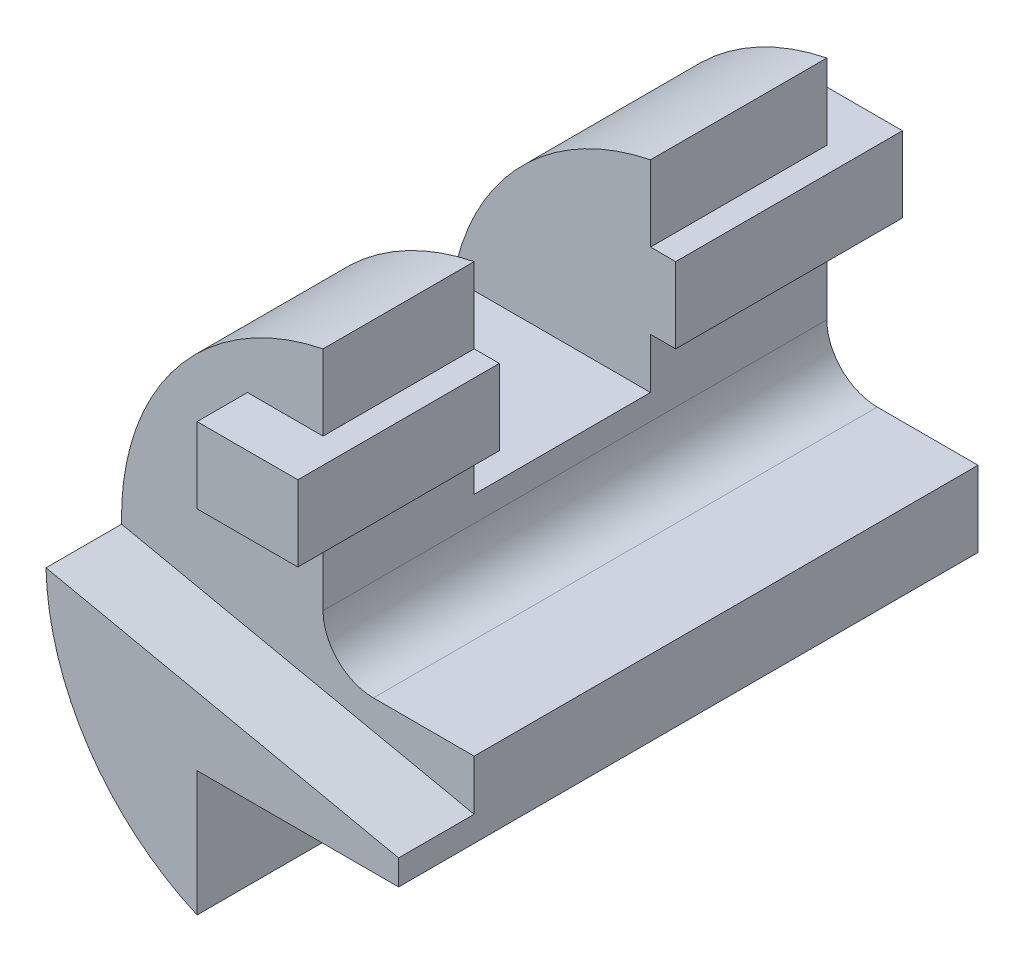
ISO-10303-21;
HEADER;
FILE_DESCRIPTION(('STEP AP214'),'2;1');
FILE_NAME('part.step','',(''),(''),'','','');
FILE_SCHEMA(('AUTOMOTIVE_DESIGN { 1 0 10303 214 1 1 1 1 }'));
ENDSEC;
DATA;
#1=APPLICATION_CONTEXT('core data for automotive mechanical design processes');
#2=APPLICATION_PROTOCOL_DEFINITION('international standard','automotive_design',2000,#1);
#3=PRODUCT_CONTEXT('',#1,'mechanical');
#4=PRODUCT('Part','Part','',(#3));
#5=PRODUCT_RELATED_PRODUCT_CATEGORY('part','',(#4));
#6=PRODUCT_DEFINITION_FORMATION('','',#4);
#7=PRODUCT_DEFINITION_CONTEXT('part definition',#1,'design');
#8=PRODUCT_DEFINITION('design','',#6,#7);
#9=PRODUCT_DEFINITION_SHAPE('','',#8);
#10=(LENGTH_UNIT() NAMED_UNIT(*) SI_UNIT(.MILLI.,.METRE.));
#11=(NAMED_UNIT(*) PLANE_ANGLE_UNIT() SI_UNIT($,.RADIAN.));
#12=(NAMED_UNIT(*) SI_UNIT($,.STERADIAN.) SOLID_ANGLE_UNIT());
#13=UNCERTAINTY_MEASURE_WITH_UNIT(LENGTH_MEASURE(1.E-05),#10,'distance_accuracy_value','');
#14=(GEOMETRIC_REPRESENTATION_CONTEXT(3) GLOBAL_UNCERTAINTY_ASSIGNED_CONTEXT((#13)) GLOBAL_UNIT_ASSIGNED_CONTEXT((#10,
#11,#12)) REPRESENTATION_CONTEXT('',''));
#15=CARTESIAN_POINT('',(0.,0.,0.));
#16=DIRECTION('',(0.,0.,1.));
#17=DIRECTION('',(1.,0.,0.));
#18=AXIS2_PLACEMENT_3D('',#15,#16,#17);
#19=CARTESIAN_POINT('',(0.,0.,100.));
#20=DIRECTION('',(0.,0.,1.));
#21=DIRECTION('',(1.,0.,0.));
#22=AXIS2_PLACEMENT_3D('',#19,#20,#21);
#23=PLANE('',#22);
#24=CARTESIAN_POINT('',(0.,0.,100.));
#25=DIRECTION('',(0.,0.,1.));
#26=DIRECTION('',(1.,0.,0.));
#27=AXIS2_PLACEMENT_3D('',#24,#25,#26);
#28=CIRCLE('',#27,50.);
#29=CARTESIAN_POINT('',(-10.,48.9897948556636,100.));
#30=VERTEX_POINT('',#29);
#31=CARTESIAN_POINT('',(-49.987139251767,-1.13397946386005,100.));
#32=VERTEX_POINT('',#31);
#33=EDGE_CURVE('E57',#30,#32,#28,.T.);
#34=ORIENTED_EDGE('',*,*,#33,.T.);
#35=DIRECTION('',(-0.978147600733806,0.207911690817756,0.));
#36=VECTOR('',#35,1.);
#37=CARTESIAN_POINT('',(20.,-16.0102051443364,100.));
#38=LINE('',#37,#36);
#39=CARTESIAN_POINT('',(20.,-16.0102051443364,100.));
#40=VERTEX_POINT('',#39);
#41=EDGE_CURVE('E52',#40,#32,#38,.T.);
#42=ORIENTED_EDGE('',*,*,#41,.F.);
#43=DIRECTION('',(0.,1.,0.));
#44=VECTOR('',#43,1.);
#45=CARTESIAN_POINT('',(20.,-21.0102051443364,100.));
#46=LINE('',#45,#44);
#47=CARTESIAN_POINT('',(20.,-6.01020514433643,100.));
#48=VERTEX_POINT('',#47);
#49=EDGE_CURVE('E220',#40,#48,#46,.T.);
#50=ORIENTED_EDGE('',*,*,#49,.T.);
#51=DIRECTION('',(-1.,0.,0.));
#52=VECTOR('',#51,1.);
#53=CARTESIAN_POINT('',(20.,-6.01020514433643,100.));
#54=LINE('',#53,#52);
#55=CARTESIAN_POINT('',(0.,-6.01020514433643,100.));
#56=VERTEX_POINT('',#55);
#57=EDGE_CURVE('E341',#48,#56,#54,.T.);
#58=ORIENTED_EDGE('',*,*,#57,.T.);
#59=CARTESIAN_POINT('',(0.,3.98979485566357,100.));
#60=DIRECTION('',(0.,0.,-1.));
#61=DIRECTION('',(-1.,0.,0.));
#62=AXIS2_PLACEMENT_3D('',#59,#60,#61);
#63=CIRCLE('',#62,10.);
#64=CARTESIAN_POINT('',(-10.,3.98979485566357,100.));
#65=VERTEX_POINT('',#64);
#66=EDGE_CURVE('E343',#56,#65,#63,.T.);
#67=ORIENTED_EDGE('',*,*,#66,.T.);
#68=DIRECTION('',(0.,1.,0.));
#69=VECTOR('',#68,1.);
#70=CARTESIAN_POINT('',(-10.,3.98979485566357,100.));
#71=LINE('',#70,#69);
#72=CARTESIAN_POINT('',(-10.,18.9897948556636,100.));
#73=VERTEX_POINT('',#72);
#74=EDGE_CURVE('E346',#65,#73,#71,.T.);
#75=ORIENTED_EDGE('',*,*,#74,.T.);
#76=DIRECTION('',(1.,0.,0.));
#77=VECTOR('',#76,1.);
#78=CARTESIAN_POINT('',(0.,18.9897948556636,100.));
#79=LINE('',#78,#77);
#80=CARTESIAN_POINT('',(-25.,18.9897948556636,100.));
#81=VERTEX_POINT('',#80);
#82=EDGE_CURVE('E261',#81,#73,#79,.T.);
#83=ORIENTED_EDGE('',*,*,#82,.F.);
#84=DIRECTION('',(0.,-1.,0.));
#85=VECTOR('',#84,1.);
#86=CARTESIAN_POINT('',(-25.,0.,100.));
#87=LINE('',#86,#85);
#88=CARTESIAN_POINT('',(-25.,33.9897948556636,100.));
#89=VERTEX_POINT('',#88);
#90=EDGE_CURVE('E266',#89,#81,#87,.T.);
#91=ORIENTED_EDGE('',*,*,#90,.F.);
#92=DIRECTION('',(-1.,0.,0.));
#93=VECTOR('',#92,1.);
#94=CARTESIAN_POINT('',(0.,33.9897948556636,100.));
#95=LINE('',#94,#93);
#96=CARTESIAN_POINT('',(-10.,33.9897948556636,100.));
#97=VERTEX_POINT('',#96);
#98=EDGE_CURVE('E249',#97,#89,#95,.T.);
#99=ORIENTED_EDGE('',*,*,#98,.F.);
#100=EDGE_CURVE('E345',#97,#30,#71,.T.);
#101=ORIENTED_EDGE('',*,*,#100,.T.);
#102=EDGE_LOOP('',(#34,#42,#50,#58,#67,#75,#83,#91,#99,#101));
#103=FACE_BOUND('',#102,.T.);
#104=ADVANCED_FACE('F37',(#103),#23,.T.);
#105=CARTESIAN_POINT('',(-10.,3.98979485566357,100.));
#106=DIRECTION('',(-1.,0.,0.));
#107=DIRECTION('',(0.,0.,1.));
#108=AXIS2_PLACEMENT_3D('',#105,#106,#107);
#109=PLANE('',#108);
#110=DIRECTION('',(0.,-1.,0.));
#111=VECTOR('',#110,1.);
#112=CARTESIAN_POINT('',(-10.,48.9897948556636,70.));
#113=LINE('',#112,#111);
#114=CARTESIAN_POINT('',(-10.,18.9897948556636,70.));
#115=VERTEX_POINT('',#114);
#116=CARTESIAN_POINT('',(-10.,8.98979485566356,70.));
#117=VERTEX_POINT('',#116);
#118=EDGE_CURVE('E321',#115,#117,#113,.T.);
#119=ORIENTED_EDGE('',*,*,#118,.F.);
#120=DIRECTION('',(0.,0.,1.));
#121=VECTOR('',#120,1.);
#122=CARTESIAN_POINT('',(-10.,18.9897948556636,100.));
#123=LINE('',#122,#121);
#124=EDGE_CURVE('E264',#115,#73,#123,.T.);
#125=ORIENTED_EDGE('',*,*,#124,.T.);
#126=ORIENTED_EDGE('',*,*,#74,.F.);
#127=DIRECTION('',(0.,0.,-1.));
#128=VECTOR('',#127,1.);
#129=CARTESIAN_POINT('',(-10.,3.98979485566357,100.));
#130=LINE('',#129,#128);
#131=CARTESIAN_POINT('',(-10.,3.98979485566357,0.));
#132=VERTEX_POINT('',#131);
#133=EDGE_CURVE('E368',#65,#132,#130,.T.);
#134=ORIENTED_EDGE('',*,*,#133,.T.);
#135=DIRECTION('',(0.,1.,0.));
#136=VECTOR('',#135,1.);
#137=CARTESIAN_POINT('',(-10.,3.98979485566357,0.));
#138=LINE('',#137,#136);
#139=CARTESIAN_POINT('',(-10.,18.9897948556636,0.));
#140=VERTEX_POINT('',#139);
#141=EDGE_CURVE('E339',#132,#140,#138,.T.);
#142=ORIENTED_EDGE('',*,*,#141,.T.);
#143=DIRECTION('',(0.,0.,1.));
#144=VECTOR('',#143,1.);
#145=CARTESIAN_POINT('',(-10.,18.9897948556636,100.));
#146=LINE('',#145,#144);
#147=CARTESIAN_POINT('',(-10.,18.9897948556636,35.));
#148=VERTEX_POINT('',#147);
#149=EDGE_CURVE('E303',#140,#148,#146,.T.);
#150=ORIENTED_EDGE('',*,*,#149,.T.);
#151=DIRECTION('',(0.,1.,0.));
#152=VECTOR('',#151,1.);
#153=CARTESIAN_POINT('',(-10.,48.9897948556636,35.));
#154=LINE('',#153,#152);
#155=CARTESIAN_POINT('',(-10.,8.98979485566356,35.));
#156=VERTEX_POINT('',#155);
#157=EDGE_CURVE('E329',#156,#148,#154,.T.);
#158=ORIENTED_EDGE('',*,*,#157,.F.);
#159=DIRECTION('',(0.,0.,-1.));
#160=VECTOR('',#159,1.);
#161=CARTESIAN_POINT('',(-10.,8.98979485566356,70.));
#162=LINE('',#161,#160);
#163=EDGE_CURVE('E325',#117,#156,#162,.T.);
#164=ORIENTED_EDGE('',*,*,#163,.F.);
#165=EDGE_LOOP('',(#119,#125,#126,#134,#142,#150,#158,#164));
#166=FACE_BOUND('',#165,.T.);
#167=ADVANCED_FACE('F402',(#166),#109,.F.);
#168=CARTESIAN_POINT('',(-10.,33.9897948556636,35.));
#169=VERTEX_POINT('',#168);
#170=CARTESIAN_POINT('',(-10.,48.9897948556636,35.));
#171=VERTEX_POINT('',#170);
#172=EDGE_CURVE('E328',#169,#171,#154,.T.);
#173=ORIENTED_EDGE('',*,*,#172,.F.);
#174=DIRECTION('',(0.,0.,-1.));
#175=VECTOR('',#174,1.);
#176=CARTESIAN_POINT('',(-10.,33.9897948556636,100.));
#177=LINE('',#176,#175);
#178=CARTESIAN_POINT('',(-10.,33.9897948556636,0.));
#179=VERTEX_POINT('',#178);
#180=EDGE_CURVE('E309',#169,#179,#177,.T.);
#181=ORIENTED_EDGE('',*,*,#180,.T.);
#182=CARTESIAN_POINT('',(-10.,48.9897948556636,0.));
#183=VERTEX_POINT('',#182);
#184=EDGE_CURVE('E362',#179,#183,#138,.T.);
#185=ORIENTED_EDGE('',*,*,#184,.T.);
#186=DIRECTION('',(0.,0.,-1.));
#187=VECTOR('',#186,1.);
#188=CARTESIAN_POINT('',(-10.,48.9897948556636,100.));
#189=LINE('',#188,#187);
#190=EDGE_CURVE('E349',#171,#183,#189,.T.);
#191=ORIENTED_EDGE('',*,*,#190,.F.);
#192=EDGE_LOOP('',(#173,#181,#185,#191));
#193=FACE_BOUND('',#192,.T.);
#194=ADVANCED_FACE('F444',(#193),#109,.F.);
#195=CARTESIAN_POINT('',(0.,0.,100.));
#196=DIRECTION('',(0.,0.,-1.));
#197=DIRECTION('',(-1.,0.,0.));
#198=AXIS2_PLACEMENT_3D('',#195,#196,#197);
#199=CYLINDRICAL_SURFACE('',#198,50.);
#200=CARTESIAN_POINT('',(-10.,48.9897948556636,70.));
#201=VERTEX_POINT('',#200);
#202=EDGE_CURVE('E365',#30,#201,#189,.T.);
#203=ORIENTED_EDGE('',*,*,#202,.T.);
#204=CARTESIAN_POINT('',(0.,0.,70.));
#205=DIRECTION('',(0.,0.,1.));
#206=DIRECTION('',(1.,0.,0.));
#207=AXIS2_PLACEMENT_3D('',#204,#205,#206);
#208=CIRCLE('',#207,50.);
#209=CARTESIAN_POINT('',(-49.1851968426791,8.98979485566356,70.));
#210=VERTEX_POINT('',#209);
#211=EDGE_CURVE('E319',#210,#201,#208,.F.);
#212=ORIENTED_EDGE('',*,*,#211,.F.);
#213=DIRECTION('',(0.,0.,-1.));
#214=VECTOR('',#213,1.);
#215=CARTESIAN_POINT('',(-49.1851968426791,8.98979485566356,100.));
#216=LINE('',#215,#214);
#217=CARTESIAN_POINT('',(-49.1851968426791,8.98979485566356,35.));
#218=VERTEX_POINT('',#217);
#219=EDGE_CURVE('E315',#218,#210,#216,.F.);
#220=ORIENTED_EDGE('',*,*,#219,.F.);
#221=CARTESIAN_POINT('',(0.,0.,35.));
#222=DIRECTION('',(0.,0.,-1.));
#223=DIRECTION('',(0.,1.,0.));
#224=AXIS2_PLACEMENT_3D('',#221,#222,#223);
#225=CIRCLE('',#224,50.);
#226=EDGE_CURVE('E317',#171,#218,#225,.F.);
#227=ORIENTED_EDGE('',*,*,#226,.F.);
#228=ORIENTED_EDGE('',*,*,#190,.T.);
#229=CARTESIAN_POINT('',(0.,0.,0.));
#230=DIRECTION('',(0.,0.,1.));
#231=DIRECTION('',(1.,0.,0.));
#232=AXIS2_PLACEMENT_3D('',#229,#230,#231);
#233=CIRCLE('',#232,50.);
#234=CARTESIAN_POINT('',(-20.,-45.8257569495584,0.));
#235=VERTEX_POINT('',#234);
#236=EDGE_CURVE('E335',#183,#235,#233,.T.);
#237=ORIENTED_EDGE('',*,*,#236,.T.);
#238=DIRECTION('',(0.,0.,-1.));
#239=VECTOR('',#238,1.);
#240=CARTESIAN_POINT('',(-20.,-45.8257569495584,100.));
#241=LINE('',#240,#239);
#242=CARTESIAN_POINT('',(-20.,-45.8257569495584,115.));
#243=VERTEX_POINT('',#242);
#244=EDGE_CURVE('E11',#243,#235,#241,.T.);
#245=ORIENTED_EDGE('',*,*,#244,.F.);
#246=CARTESIAN_POINT('',(0.,0.,115.));
#247=DIRECTION('',(0.,0.,1.));
#248=DIRECTION('',(1.,0.,0.));
#249=AXIS2_PLACEMENT_3D('',#246,#247,#248);
#250=CIRCLE('',#249,50.);
#251=CARTESIAN_POINT('',(-49.987139251767,-1.13397946386005,115.));
#252=VERTEX_POINT('',#251);
#253=EDGE_CURVE('E206',#252,#243,#250,.T.);
#254=ORIENTED_EDGE('',*,*,#253,.F.);
#255=DIRECTION('',(0.,0.,-1.));
#256=VECTOR('',#255,1.);
#257=CARTESIAN_POINT('',(-49.987139251767,-1.13397946386005,115.));
#258=LINE('',#257,#256);
#259=EDGE_CURVE('E202',#252,#32,#258,.T.);
#260=ORIENTED_EDGE('',*,*,#259,.T.);
#261=ORIENTED_EDGE('',*,*,#33,.F.);
#262=EDGE_LOOP('',(#203,#212,#220,#227,#228,#237,#245,#254,#260,#261));
#263=FACE_BOUND('',#262,.T.);
#264=ADVANCED_FACE('F39',(#263),#199,.T.);
#265=CARTESIAN_POINT('',(-20.,-45.8257569495584,100.));
#266=DIRECTION('',(-1.,0.,0.));
#267=DIRECTION('',(0.,0.,1.));
#268=AXIS2_PLACEMENT_3D('',#265,#266,#267);
#269=PLANE('',#268);
#270=DIRECTION('',(0.,1.,0.));
#271=VECTOR('',#270,1.);
#272=CARTESIAN_POINT('',(-20.,-45.8257569495584,0.));
#273=LINE('',#272,#271);
#274=CARTESIAN_POINT('',(-20.,-21.0102051443364,0.));
#275=VERTEX_POINT('',#274);
#276=EDGE_CURVE('E352',#235,#275,#273,.T.);
#277=ORIENTED_EDGE('',*,*,#276,.T.);
#278=DIRECTION('',(0.,0.,-1.));
#279=VECTOR('',#278,1.);
#280=CARTESIAN_POINT('',(-20.,-21.0102051443364,100.));
#281=LINE('',#280,#279);
#282=CARTESIAN_POINT('',(-20.,-21.0102051443364,115.));
#283=VERTEX_POINT('',#282);
#284=EDGE_CURVE('E45',#283,#275,#281,.T.);
#285=ORIENTED_EDGE('',*,*,#284,.F.);
#286=DIRECTION('',(0.,1.,0.));
#287=VECTOR('',#286,1.);
#288=CARTESIAN_POINT('',(-20.,-45.8257569495584,115.));
#289=LINE('',#288,#287);
#290=EDGE_CURVE('E435',#243,#283,#289,.T.);
#291=ORIENTED_EDGE('',*,*,#290,.F.);
#292=ORIENTED_EDGE('',*,*,#244,.T.);
#293=EDGE_LOOP('',(#277,#285,#291,#292));
#294=FACE_BOUND('',#293,.T.);
#295=ADVANCED_FACE('F439',(#294),#269,.F.);
#296=CARTESIAN_POINT('',(-20.,-21.0102051443364,100.));
#297=DIRECTION('',(0.,1.,0.));
#298=DIRECTION('',(-1.,0.,0.));
#299=AXIS2_PLACEMENT_3D('',#296,#297,#298);
#300=PLANE('',#299);
#301=DIRECTION('',(1.,0.,0.));
#302=VECTOR('',#301,1.);
#303=CARTESIAN_POINT('',(-20.,-21.0102051443364,0.));
#304=LINE('',#303,#302);
#305=CARTESIAN_POINT('',(20.,-21.0102051443364,0.));
#306=VERTEX_POINT('',#305);
#307=EDGE_CURVE('E354',#275,#306,#304,.T.);
#308=ORIENTED_EDGE('',*,*,#307,.T.);
#309=DIRECTION('',(0.,0.,-1.));
#310=VECTOR('',#309,1.);
#311=CARTESIAN_POINT('',(20.,-21.0102051443364,100.));
#312=LINE('',#311,#310);
#313=CARTESIAN_POINT('',(20.,-21.0102051443364,115.));
#314=VERTEX_POINT('',#313);
#315=EDGE_CURVE('E377',#314,#306,#312,.T.);
#316=ORIENTED_EDGE('',*,*,#315,.F.);
#317=DIRECTION('',(1.,0.,0.));
#318=VECTOR('',#317,1.);
#319=CARTESIAN_POINT('',(-20.,-21.0102051443364,115.));
#320=LINE('',#319,#318);
#321=EDGE_CURVE('E214',#283,#314,#320,.T.);
#322=ORIENTED_EDGE('',*,*,#321,.F.);
#323=ORIENTED_EDGE('',*,*,#284,.T.);
#324=EDGE_LOOP('',(#308,#316,#322,#323));
#325=FACE_BOUND('',#324,.T.);
#326=ADVANCED_FACE('F381',(#325),#300,.F.);
#327=CARTESIAN_POINT('',(20.,-21.0102051443364,100.));
#328=DIRECTION('',(-1.,0.,0.));
#329=DIRECTION('',(0.,-1.,0.));
#330=AXIS2_PLACEMENT_3D('',#327,#328,#329);
#331=PLANE('',#330);
#332=DIRECTION('',(0.,1.,0.));
#333=VECTOR('',#332,1.);
#334=CARTESIAN_POINT('',(20.,-21.0102051443364,0.));
#335=LINE('',#334,#333);
#336=CARTESIAN_POINT('',(20.,-6.01020514433643,0.));
#337=VERTEX_POINT('',#336);
#338=EDGE_CURVE('E356',#306,#337,#335,.T.);
#339=ORIENTED_EDGE('',*,*,#338,.T.);
#340=DIRECTION('',(0.,0.,-1.));
#341=VECTOR('',#340,1.);
#342=CARTESIAN_POINT('',(20.,-6.01020514433643,100.));
#343=LINE('',#342,#341);
#344=EDGE_CURVE('E374',#48,#337,#343,.T.);
#345=ORIENTED_EDGE('',*,*,#344,.F.);
#346=ORIENTED_EDGE('',*,*,#49,.F.);
#347=DIRECTION('',(0.,0.,-1.));
#348=VECTOR('',#347,1.);
#349=CARTESIAN_POINT('',(20.,-16.0102051443364,115.));
#350=LINE('',#349,#348);
#351=CARTESIAN_POINT('',(20.,-16.0102051443364,115.));
#352=VERTEX_POINT('',#351);
#353=EDGE_CURVE('E200',#352,#40,#350,.T.);
#354=ORIENTED_EDGE('',*,*,#353,.F.);
#355=DIRECTION('',(0.,1.,0.));
#356=VECTOR('',#355,1.);
#357=CARTESIAN_POINT('',(20.,-16.0102051443364,115.));
#358=LINE('',#357,#356);
#359=EDGE_CURVE('E207',#314,#352,#358,.T.);
#360=ORIENTED_EDGE('',*,*,#359,.F.);
#361=ORIENTED_EDGE('',*,*,#315,.T.);
#362=EDGE_LOOP('',(#339,#345,#346,#354,#360,#361));
#363=FACE_BOUND('',#362,.T.);
#364=ADVANCED_FACE('F218',(#363),#331,.F.);
#365=CARTESIAN_POINT('',(20.,-6.01020514433643,100.));
#366=DIRECTION('',(0.,-1.,0.));
#367=DIRECTION('',(1.,0.,0.));
#368=AXIS2_PLACEMENT_3D('',#365,#366,#367);
#369=PLANE('',#368);
#370=DIRECTION('',(-1.,0.,0.));
#371=VECTOR('',#370,1.);
#372=CARTESIAN_POINT('',(20.,-6.01020514433643,0.));
#373=LINE('',#372,#371);
#374=CARTESIAN_POINT('',(0.,-6.01020514433643,0.));
#375=VERTEX_POINT('',#374);
#376=EDGE_CURVE('E358',#337,#375,#373,.T.);
#377=ORIENTED_EDGE('',*,*,#376,.T.);
#378=DIRECTION('',(0.,0.,-1.));
#379=VECTOR('',#378,1.);
#380=CARTESIAN_POINT('',(0.,-6.01020514433643,100.));
#381=LINE('',#380,#379);
#382=EDGE_CURVE('E371',#56,#375,#381,.T.);
#383=ORIENTED_EDGE('',*,*,#382,.F.);
#384=ORIENTED_EDGE('',*,*,#57,.F.);
#385=ORIENTED_EDGE('',*,*,#344,.T.);
#386=EDGE_LOOP('',(#377,#383,#384,#385));
#387=FACE_BOUND('',#386,.T.);
#388=ADVANCED_FACE('F393',(#387),#369,.F.);
#389=CARTESIAN_POINT('',(0.,3.98979485566357,100.));
#390=DIRECTION('',(0.,0.,-1.));
#391=DIRECTION('',(-1.,0.,0.));
#392=AXIS2_PLACEMENT_3D('',#389,#390,#391);
#393=CYLINDRICAL_SURFACE('',#392,10.);
#394=CARTESIAN_POINT('',(0.,3.98979485566357,0.));
#395=DIRECTION('',(0.,0.,-1.));
#396=DIRECTION('',(-1.,0.,0.));
#397=AXIS2_PLACEMENT_3D('',#394,#395,#396);
#398=CIRCLE('',#397,10.);
#399=EDGE_CURVE('E360',#375,#132,#398,.T.);
#400=ORIENTED_EDGE('',*,*,#399,.T.);
#401=ORIENTED_EDGE('',*,*,#133,.F.);
#402=ORIENTED_EDGE('',*,*,#66,.F.);
#403=ORIENTED_EDGE('',*,*,#382,.T.);
#404=EDGE_LOOP('',(#400,#401,#402,#403));
#405=FACE_BOUND('',#404,.T.);
#406=ADVANCED_FACE('F399',(#405),#393,.F.);
#407=ORIENTED_EDGE('',*,*,#100,.F.);
#408=DIRECTION('',(0.,0.,-1.));
#409=VECTOR('',#408,1.);
#410=CARTESIAN_POINT('',(-10.,33.9897948556636,100.));
#411=LINE('',#410,#409);
#412=CARTESIAN_POINT('',(-10.,33.9897948556636,70.));
#413=VERTEX_POINT('',#412);
#414=EDGE_CURVE('E259',#97,#413,#411,.T.);
#415=ORIENTED_EDGE('',*,*,#414,.T.);
#416=EDGE_CURVE('E322',#201,#413,#113,.T.);
#417=ORIENTED_EDGE('',*,*,#416,.F.);
#418=ORIENTED_EDGE('',*,*,#202,.F.);
#419=EDGE_LOOP('',(#407,#415,#417,#418));
#420=FACE_BOUND('',#419,.T.);
#421=ADVANCED_FACE('F429',(#420),#109,.F.);
#422=CARTESIAN_POINT('',(0.,0.,0.));
#423=DIRECTION('',(0.,0.,1.));
#424=DIRECTION('',(1.,0.,0.));
#425=AXIS2_PLACEMENT_3D('',#422,#423,#424);
#426=PLANE('',#425);
#427=ORIENTED_EDGE('',*,*,#184,.F.);
#428=DIRECTION('',(-1.,0.,0.));
#429=VECTOR('',#428,1.);
#430=CARTESIAN_POINT('',(0.,33.9897948556636,0.));
#431=LINE('',#430,#429);
#432=CARTESIAN_POINT('',(-25.,33.9897948556636,0.));
#433=VERTEX_POINT('',#432);
#434=EDGE_CURVE('E306',#179,#433,#431,.T.);
#435=ORIENTED_EDGE('',*,*,#434,.T.);
#436=DIRECTION('',(0.,-1.,0.));
#437=VECTOR('',#436,1.);
#438=CARTESIAN_POINT('',(-25.,0.,0.));
#439=LINE('',#438,#437);
#440=CARTESIAN_POINT('',(-25.,18.9897948556636,0.));
#441=VERTEX_POINT('',#440);
#442=EDGE_CURVE('E312',#433,#441,#439,.T.);
#443=ORIENTED_EDGE('',*,*,#442,.T.);
#444=DIRECTION('',(1.,0.,0.));
#445=VECTOR('',#444,1.);
#446=CARTESIAN_POINT('',(0.,18.9897948556636,0.));
#447=LINE('',#446,#445);
#448=EDGE_CURVE('E293',#441,#140,#447,.T.);
#449=ORIENTED_EDGE('',*,*,#448,.T.);
#450=ORIENTED_EDGE('',*,*,#141,.F.);
#451=ORIENTED_EDGE('',*,*,#399,.F.);
#452=ORIENTED_EDGE('',*,*,#376,.F.);
#453=ORIENTED_EDGE('',*,*,#338,.F.);
#454=ORIENTED_EDGE('',*,*,#307,.F.);
#455=ORIENTED_EDGE('',*,*,#276,.F.);
#456=ORIENTED_EDGE('',*,*,#236,.F.);
#457=EDGE_LOOP('',(#427,#435,#443,#449,#450,#451,#452,#453,#454,#455,#456));
#458=FACE_BOUND('',#457,.T.);
#459=ADVANCED_FACE('F387',(#458),#426,.F.);
#460=CARTESIAN_POINT('',(-50.001,48.9897948556636,70.));
#461=DIRECTION('',(0.,0.,1.));
#462=DIRECTION('',(1.,0.,0.));
#463=AXIS2_PLACEMENT_3D('',#460,#461,#462);
#464=PLANE('',#463);
#465=ORIENTED_EDGE('',*,*,#416,.T.);
#466=DIRECTION('',(1.,0.,0.));
#467=VECTOR('',#466,1.);
#468=CARTESIAN_POINT('',(-25.,33.9897948556636,70.));
#469=LINE('',#468,#467);
#470=CARTESIAN_POINT('',(-5.,33.9897948556636,70.));
#471=VERTEX_POINT('',#470);
#472=EDGE_CURVE('E221',#413,#471,#469,.T.);
#473=ORIENTED_EDGE('',*,*,#472,.T.);
#474=DIRECTION('',(0.,-1.,0.));
#475=VECTOR('',#474,1.);
#476=CARTESIAN_POINT('',(-5.,33.9897948556636,70.));
#477=LINE('',#476,#475);
#478=CARTESIAN_POINT('',(-5.,18.9897948556636,70.));
#479=VERTEX_POINT('',#478);
#480=EDGE_CURVE('E223',#471,#479,#477,.T.);
#481=ORIENTED_EDGE('',*,*,#480,.T.);
#482=DIRECTION('',(-1.,0.,0.));
#483=VECTOR('',#482,1.);
#484=CARTESIAN_POINT('',(-25.,18.9897948556636,70.));
#485=LINE('',#484,#483);
#486=EDGE_CURVE('E232',#479,#115,#485,.T.);
#487=ORIENTED_EDGE('',*,*,#486,.T.);
#488=ORIENTED_EDGE('',*,*,#118,.T.);
#489=DIRECTION('',(1.,0.,0.));
#490=VECTOR('',#489,1.);
#491=CARTESIAN_POINT('',(-50.001,8.98979485566356,70.));
#492=LINE('',#491,#490);
#493=EDGE_CURVE('E332',#210,#117,#492,.T.);
#494=ORIENTED_EDGE('',*,*,#493,.F.);
#495=ORIENTED_EDGE('',*,*,#211,.T.);
#496=EDGE_LOOP('',(#465,#473,#481,#487,#488,#494,#495));
#497=FACE_BOUND('',#496,.T.);
#498=ADVANCED_FACE('F409',(#497),#464,.F.);
#499=CARTESIAN_POINT('',(-50.001,48.9897948556636,35.));
#500=DIRECTION('',(0.,0.,-1.));
#501=DIRECTION('',(0.,1.,0.));
#502=AXIS2_PLACEMENT_3D('',#499,#500,#501);
#503=PLANE('',#502);
#504=ORIENTED_EDGE('',*,*,#157,.T.);
#505=DIRECTION('',(1.,0.,0.));
#506=VECTOR('',#505,1.);
#507=CARTESIAN_POINT('',(-25.,18.9897948556636,35.));
#508=LINE('',#507,#506);
#509=CARTESIAN_POINT('',(-5.,18.9897948556636,35.));
#510=VERTEX_POINT('',#509);
#511=EDGE_CURVE('E269',#148,#510,#508,.T.);
#512=ORIENTED_EDGE('',*,*,#511,.T.);
#513=DIRECTION('',(0.,1.,0.));
#514=VECTOR('',#513,1.);
#515=CARTESIAN_POINT('',(-5.,33.9897948556636,35.));
#516=LINE('',#515,#514);
#517=CARTESIAN_POINT('',(-5.,33.9897948556636,35.));
#518=VERTEX_POINT('',#517);
#519=EDGE_CURVE('E285',#510,#518,#516,.T.);
#520=ORIENTED_EDGE('',*,*,#519,.T.);
#521=DIRECTION('',(-1.,0.,0.));
#522=VECTOR('',#521,1.);
#523=CARTESIAN_POINT('',(-25.,33.9897948556636,35.));
#524=LINE('',#523,#522);
#525=EDGE_CURVE('E274',#518,#169,#524,.T.);
#526=ORIENTED_EDGE('',*,*,#525,.T.);
#527=ORIENTED_EDGE('',*,*,#172,.T.);
#528=ORIENTED_EDGE('',*,*,#226,.T.);
#529=DIRECTION('',(1.,0.,0.));
#530=VECTOR('',#529,1.);
#531=CARTESIAN_POINT('',(-50.001,8.98979485566356,35.));
#532=LINE('',#531,#530);
#533=EDGE_CURVE('E333',#218,#156,#532,.T.);
#534=ORIENTED_EDGE('',*,*,#533,.T.);
#535=EDGE_LOOP('',(#504,#512,#520,#526,#527,#528,#534));
#536=FACE_BOUND('',#535,.T.);
#537=ADVANCED_FACE('F449',(#536),#503,.F.);
#538=CARTESIAN_POINT('',(-50.001,8.98979485566356,70.));
#539=DIRECTION('',(0.,-1.,0.));
#540=DIRECTION('',(0.,0.,-1.));
#541=AXIS2_PLACEMENT_3D('',#538,#539,#540);
#542=PLANE('',#541);
#543=ORIENTED_EDGE('',*,*,#219,.T.);
#544=ORIENTED_EDGE('',*,*,#493,.T.);
#545=ORIENTED_EDGE('',*,*,#163,.T.);
#546=ORIENTED_EDGE('',*,*,#533,.F.);
#547=EDGE_LOOP('',(#543,#544,#545,#546));
#548=FACE_BOUND('',#547,.T.);
#549=ADVANCED_FACE('F465',(#548),#542,.F.);
#550=CARTESIAN_POINT('',(-25.,33.9897948556636,-10.));
#551=DIRECTION('',(-1.,0.,0.));
#552=DIRECTION('',(0.,-1.,0.));
#553=AXIS2_PLACEMENT_3D('',#550,#551,#552);
#554=PLANE('',#553);
#555=ORIENTED_EDGE('',*,*,#442,.F.);
#556=DIRECTION('',(0.,0.,1.));
#557=VECTOR('',#556,1.);
#558=CARTESIAN_POINT('',(-25.,33.9897948556636,-10.));
#559=LINE('',#558,#557);
#560=CARTESIAN_POINT('',(-25.,33.9897948556636,-10.));
#561=VERTEX_POINT('',#560);
#562=EDGE_CURVE('E290',#561,#433,#559,.T.);
#563=ORIENTED_EDGE('',*,*,#562,.F.);
#564=DIRECTION('',(0.,-1.,0.));
#565=VECTOR('',#564,1.);
#566=CARTESIAN_POINT('',(-25.,33.9897948556636,-10.));
#567=LINE('',#566,#565);
#568=CARTESIAN_POINT('',(-25.,18.9897948556636,-10.));
#569=VERTEX_POINT('',#568);
#570=EDGE_CURVE('E270',#561,#569,#567,.T.);
#571=ORIENTED_EDGE('',*,*,#570,.T.);
#572=DIRECTION('',(0.,0.,1.));
#573=VECTOR('',#572,1.);
#574=CARTESIAN_POINT('',(-25.,18.9897948556636,-10.));
#575=LINE('',#574,#573);
#576=EDGE_CURVE('E283',#569,#441,#575,.T.);
#577=ORIENTED_EDGE('',*,*,#576,.T.);
#578=EDGE_LOOP('',(#555,#563,#571,#577));
#579=FACE_BOUND('',#578,.T.);
#580=ADVANCED_FACE('F460',(#579),#554,.T.);
#581=CARTESIAN_POINT('',(-25.,33.9897948556636,-10.));
#582=DIRECTION('',(0.,1.,0.));
#583=DIRECTION('',(0.,0.,1.));
#584=AXIS2_PLACEMENT_3D('',#581,#582,#583);
#585=PLANE('',#584);
#586=ORIENTED_EDGE('',*,*,#180,.F.);
#587=ORIENTED_EDGE('',*,*,#525,.F.);
#588=DIRECTION('',(0.,0.,1.));
#589=VECTOR('',#588,1.);
#590=CARTESIAN_POINT('',(-5.,33.9897948556636,-10.));
#591=LINE('',#590,#589);
#592=CARTESIAN_POINT('',(-5.,33.9897948556636,-10.));
#593=VERTEX_POINT('',#592);
#594=EDGE_CURVE('E294',#593,#518,#591,.T.);
#595=ORIENTED_EDGE('',*,*,#594,.F.);
#596=DIRECTION('',(-1.,0.,0.));
#597=VECTOR('',#596,1.);
#598=CARTESIAN_POINT('',(-25.,33.9897948556636,-10.));
#599=LINE('',#598,#597);
#600=EDGE_CURVE('E280',#593,#561,#599,.T.);
#601=ORIENTED_EDGE('',*,*,#600,.T.);
#602=ORIENTED_EDGE('',*,*,#562,.T.);
#603=ORIENTED_EDGE('',*,*,#434,.F.);
#604=EDGE_LOOP('',(#586,#587,#595,#601,#602,#603));
#605=FACE_BOUND('',#604,.T.);
#606=ADVANCED_FACE('F447',(#605),#585,.T.);
#607=CARTESIAN_POINT('',(-25.,18.9897948556636,-10.));
#608=DIRECTION('',(0.,-1.,0.));
#609=DIRECTION('',(0.,0.,-1.));
#610=AXIS2_PLACEMENT_3D('',#607,#608,#609);
#611=PLANE('',#610);
#612=ORIENTED_EDGE('',*,*,#149,.F.);
#613=ORIENTED_EDGE('',*,*,#448,.F.);
#614=ORIENTED_EDGE('',*,*,#576,.F.);
#615=DIRECTION('',(1.,0.,0.));
#616=VECTOR('',#615,1.);
#617=CARTESIAN_POINT('',(-25.,18.9897948556636,-10.));
#618=LINE('',#617,#616);
#619=CARTESIAN_POINT('',(-5.,18.9897948556636,-10.));
#620=VERTEX_POINT('',#619);
#621=EDGE_CURVE('E273',#569,#620,#618,.T.);
#622=ORIENTED_EDGE('',*,*,#621,.T.);
#623=DIRECTION('',(0.,0.,1.));
#624=VECTOR('',#623,1.);
#625=CARTESIAN_POINT('',(-5.,18.9897948556636,-10.));
#626=LINE('',#625,#624);
#627=EDGE_CURVE('E296',#620,#510,#626,.T.);
#628=ORIENTED_EDGE('',*,*,#627,.T.);
#629=ORIENTED_EDGE('',*,*,#511,.F.);
#630=EDGE_LOOP('',(#612,#613,#614,#622,#628,#629));
#631=FACE_BOUND('',#630,.T.);
#632=ADVANCED_FACE('F619',(#631),#611,.T.);
#633=CARTESIAN_POINT('',(-5.,33.9897948556636,-10.));
#634=DIRECTION('',(1.,0.,0.));
#635=DIRECTION('',(0.,1.,0.));
#636=AXIS2_PLACEMENT_3D('',#633,#634,#635);
#637=PLANE('',#636);
#638=ORIENTED_EDGE('',*,*,#519,.F.);
#639=ORIENTED_EDGE('',*,*,#627,.F.);
#640=DIRECTION('',(0.,1.,0.));
#641=VECTOR('',#640,1.);
#642=CARTESIAN_POINT('',(-5.,33.9897948556636,-10.));
#643=LINE('',#642,#641);
#644=EDGE_CURVE('E277',#620,#593,#643,.T.);
#645=ORIENTED_EDGE('',*,*,#644,.T.);
#646=ORIENTED_EDGE('',*,*,#594,.T.);
#647=EDGE_LOOP('',(#638,#639,#645,#646));
#648=FACE_BOUND('',#647,.T.);
#649=ADVANCED_FACE('F452',(#648),#637,.T.);
#650=CARTESIAN_POINT('',(0.,0.,-10.));
#651=DIRECTION('',(0.,0.,1.));
#652=DIRECTION('',(1.,0.,0.));
#653=AXIS2_PLACEMENT_3D('',#650,#651,#652);
#654=PLANE('',#653);
#655=ORIENTED_EDGE('',*,*,#570,.F.);
#656=ORIENTED_EDGE('',*,*,#600,.F.);
#657=ORIENTED_EDGE('',*,*,#644,.F.);
#658=ORIENTED_EDGE('',*,*,#621,.F.);
#659=EDGE_LOOP('',(#655,#656,#657,#658));
#660=FACE_BOUND('',#659,.T.);
#661=ADVANCED_FACE('F457',(#660),#654,.F.);
#662=CARTESIAN_POINT('',(-25.,18.9897948556636,110.));
#663=DIRECTION('',(0.,-1.,0.));
#664=DIRECTION('',(0.,0.,-1.));
#665=AXIS2_PLACEMENT_3D('',#662,#663,#664);
#666=PLANE('',#665);
#667=ORIENTED_EDGE('',*,*,#124,.F.);
#668=ORIENTED_EDGE('',*,*,#486,.F.);
#669=DIRECTION('',(0.,0.,-1.));
#670=VECTOR('',#669,1.);
#671=CARTESIAN_POINT('',(-5.,18.9897948556636,110.));
#672=LINE('',#671,#670);
#673=CARTESIAN_POINT('',(-5.,18.9897948556636,110.));
#674=VERTEX_POINT('',#673);
#675=EDGE_CURVE('E250',#674,#479,#672,.T.);
#676=ORIENTED_EDGE('',*,*,#675,.F.);
#677=DIRECTION('',(-1.,0.,0.));
#678=VECTOR('',#677,1.);
#679=CARTESIAN_POINT('',(-25.,18.9897948556636,110.));
#680=LINE('',#679,#678);
#681=CARTESIAN_POINT('',(-25.,18.9897948556636,110.));
#682=VERTEX_POINT('',#681);
#683=EDGE_CURVE('E238',#674,#682,#680,.T.);
#684=ORIENTED_EDGE('',*,*,#683,.T.);
#685=DIRECTION('',(0.,0.,-1.));
#686=VECTOR('',#685,1.);
#687=CARTESIAN_POINT('',(-25.,18.9897948556636,110.));
#688=LINE('',#687,#686);
#689=EDGE_CURVE('E246',#682,#81,#688,.T.);
#690=ORIENTED_EDGE('',*,*,#689,.T.);
#691=ORIENTED_EDGE('',*,*,#82,.T.);
#692=EDGE_LOOP('',(#667,#668,#676,#684,#690,#691));
#693=FACE_BOUND('',#692,.T.);
#694=ADVANCED_FACE('F407',(#693),#666,.T.);
#695=CARTESIAN_POINT('',(-25.,33.9897948556636,110.));
#696=DIRECTION('',(0.,1.,0.));
#697=DIRECTION('',(0.,0.,1.));
#698=AXIS2_PLACEMENT_3D('',#695,#696,#697);
#699=PLANE('',#698);
#700=ORIENTED_EDGE('',*,*,#414,.F.);
#701=ORIENTED_EDGE('',*,*,#98,.T.);
#702=DIRECTION('',(0.,0.,-1.));
#703=VECTOR('',#702,1.);
#704=CARTESIAN_POINT('',(-25.,33.9897948556636,110.));
#705=LINE('',#704,#703);
#706=CARTESIAN_POINT('',(-25.,33.9897948556636,110.));
#707=VERTEX_POINT('',#706);
#708=EDGE_CURVE('E240',#707,#89,#705,.T.);
#709=ORIENTED_EDGE('',*,*,#708,.F.);
#710=DIRECTION('',(1.,0.,0.));
#711=VECTOR('',#710,1.);
#712=CARTESIAN_POINT('',(-25.,33.9897948556636,110.));
#713=LINE('',#712,#711);
#714=CARTESIAN_POINT('',(-5.,33.9897948556636,110.));
#715=VERTEX_POINT('',#714);
#716=EDGE_CURVE('E231',#707,#715,#713,.T.);
#717=ORIENTED_EDGE('',*,*,#716,.T.);
#718=DIRECTION('',(0.,0.,-1.));
#719=VECTOR('',#718,1.);
#720=CARTESIAN_POINT('',(-5.,33.9897948556636,110.));
#721=LINE('',#720,#719);
#722=EDGE_CURVE('E252',#715,#471,#721,.T.);
#723=ORIENTED_EDGE('',*,*,#722,.T.);
#724=ORIENTED_EDGE('',*,*,#472,.F.);
#725=EDGE_LOOP('',(#700,#701,#709,#717,#723,#724));
#726=FACE_BOUND('',#725,.T.);
#727=ADVANCED_FACE('F426',(#726),#699,.T.);
#728=CARTESIAN_POINT('',(-25.,33.9897948556636,110.));
#729=DIRECTION('',(-1.,0.,0.));
#730=DIRECTION('',(0.,0.,1.));
#731=AXIS2_PLACEMENT_3D('',#728,#729,#730);
#732=PLANE('',#731);
#733=ORIENTED_EDGE('',*,*,#708,.T.);
#734=ORIENTED_EDGE('',*,*,#90,.T.);
#735=ORIENTED_EDGE('',*,*,#689,.F.);
#736=DIRECTION('',(0.,1.,0.));
#737=VECTOR('',#736,1.);
#738=CARTESIAN_POINT('',(-25.,33.9897948556636,110.));
#739=LINE('',#738,#737);
#740=EDGE_CURVE('E228',#682,#707,#739,.T.);
#741=ORIENTED_EDGE('',*,*,#740,.T.);
#742=EDGE_LOOP('',(#733,#734,#735,#741));
#743=FACE_BOUND('',#742,.T.);
#744=ADVANCED_FACE('F422',(#743),#732,.T.);
#745=CARTESIAN_POINT('',(-5.,33.9897948556636,110.));
#746=DIRECTION('',(1.,0.,0.));
#747=DIRECTION('',(0.,0.,-1.));
#748=AXIS2_PLACEMENT_3D('',#745,#746,#747);
#749=PLANE('',#748);
#750=ORIENTED_EDGE('',*,*,#480,.F.);
#751=ORIENTED_EDGE('',*,*,#722,.F.);
#752=DIRECTION('',(0.,-1.,0.));
#753=VECTOR('',#752,1.);
#754=CARTESIAN_POINT('',(-5.,33.9897948556636,110.));
#755=LINE('',#754,#753);
#756=EDGE_CURVE('E235',#715,#674,#755,.T.);
#757=ORIENTED_EDGE('',*,*,#756,.T.);
#758=ORIENTED_EDGE('',*,*,#675,.T.);
#759=EDGE_LOOP('',(#750,#751,#757,#758));
#760=FACE_BOUND('',#759,.T.);
#761=ADVANCED_FACE('F414',(#760),#749,.T.);
#762=CARTESIAN_POINT('',(0.,0.,110.));
#763=DIRECTION('',(0.,0.,1.));
#764=DIRECTION('',(1.,0.,0.));
#765=AXIS2_PLACEMENT_3D('',#762,#763,#764);
#766=PLANE('',#765);
#767=ORIENTED_EDGE('',*,*,#740,.F.);
#768=ORIENTED_EDGE('',*,*,#683,.F.);
#769=ORIENTED_EDGE('',*,*,#756,.F.);
#770=ORIENTED_EDGE('',*,*,#716,.F.);
#771=EDGE_LOOP('',(#767,#768,#769,#770));
#772=FACE_BOUND('',#771,.T.);
#773=ADVANCED_FACE('F419',(#772),#766,.T.);
#774=CARTESIAN_POINT('',(20.,-16.0102051443364,115.));
#775=DIRECTION('',(-0.207911690817756,-0.978147600733806,0.));
#776=DIRECTION('',(0.978147600733806,-0.207911690817756,0.));
#777=AXIS2_PLACEMENT_3D('',#774,#775,#776);
#778=PLANE('',#777);
#779=ORIENTED_EDGE('',*,*,#41,.T.);
#780=ORIENTED_EDGE('',*,*,#259,.F.);
#781=DIRECTION('',(-0.978147600733806,0.207911690817756,0.));
#782=VECTOR('',#781,1.);
#783=CARTESIAN_POINT('',(20.,-16.0102051443364,115.));
#784=LINE('',#783,#782);
#785=EDGE_CURVE('E196',#352,#252,#784,.T.);
#786=ORIENTED_EDGE('',*,*,#785,.F.);
#787=ORIENTED_EDGE('',*,*,#353,.T.);
#788=EDGE_LOOP('',(#779,#780,#786,#787));
#789=FACE_BOUND('',#788,.T.);
#790=ADVANCED_FACE('F198',(#789),#778,.F.);
#791=CARTESIAN_POINT('',(0.,0.,115.));
#792=DIRECTION('',(0.,0.,1.));
#793=DIRECTION('',(1.,0.,0.));
#794=AXIS2_PLACEMENT_3D('',#791,#792,#793);
#795=PLANE('',#794);
#796=ORIENTED_EDGE('',*,*,#359,.T.);
#797=ORIENTED_EDGE('',*,*,#785,.T.);
#798=ORIENTED_EDGE('',*,*,#253,.T.);
#799=ORIENTED_EDGE('',*,*,#290,.T.);
#800=ORIENTED_EDGE('',*,*,#321,.T.);
#801=EDGE_LOOP('',(#796,#797,#798,#799,#800));
#802=FACE_BOUND('',#801,.T.);
#803=ADVANCED_FACE('F211',(#802),#795,.T.);
#804=CLOSED_SHELL('',(#104,#167,#194,#264,#295,#326,#364,#388,#406,#421,#459,#498,#537,#549,
#580,#606,#632,#649,#661,#694,#727,#744,#761,#773,#790,#803));
#805=MANIFOLD_SOLID_BREP('B2',#804);
#806=ADVANCED_BREP_SHAPE_REPRESENTATION('',(#18,#805),#14);
#807=SHAPE_DEFINITION_REPRESENTATION(#9,#806);
ENDSEC;
END-ISO-10303-21;
